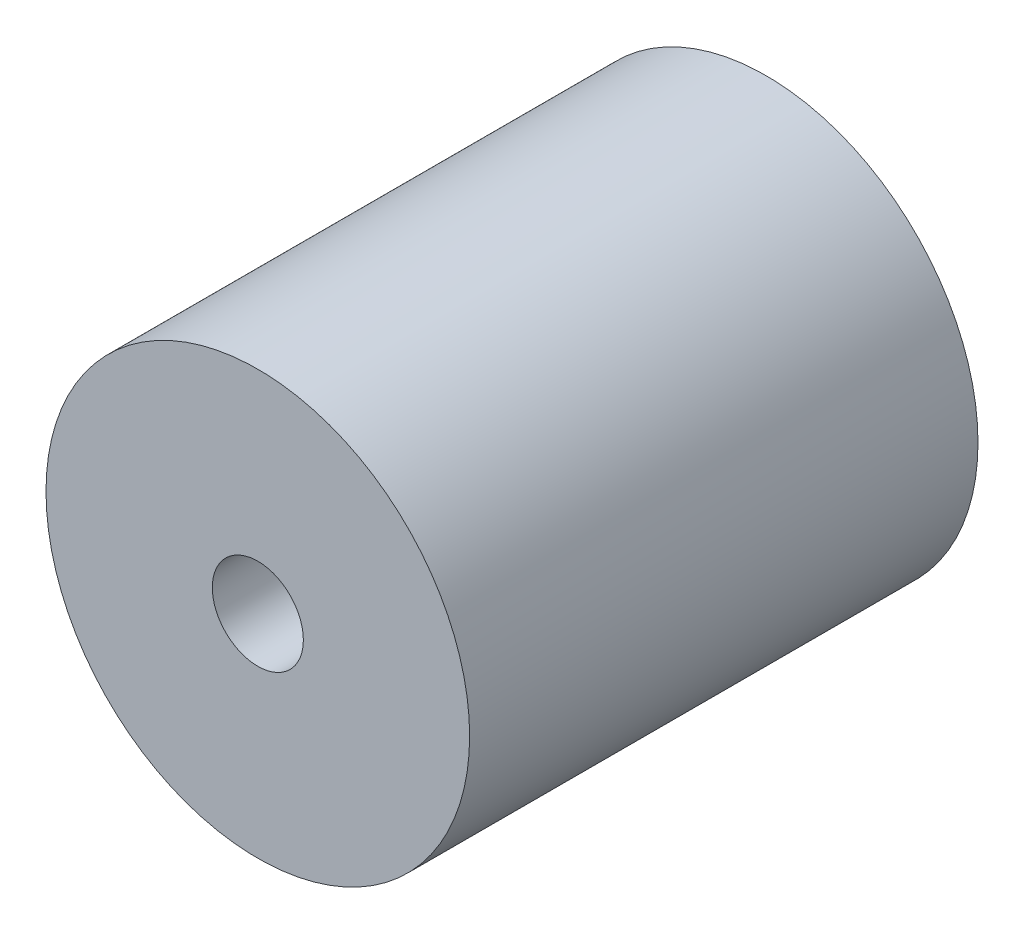
ISO-10303-21;
HEADER;
FILE_DESCRIPTION(('STEP AP214'),'2;1');
FILE_NAME('part.step','',(''),(''),'','','');
FILE_SCHEMA(('AUTOMOTIVE_DESIGN { 1 0 10303 214 1 1 1 1 }'));
ENDSEC;
DATA;
#1=APPLICATION_CONTEXT('core data for automotive mechanical design processes');
#2=APPLICATION_PROTOCOL_DEFINITION('international standard','automotive_design',2000,#1);
#3=PRODUCT_CONTEXT('',#1,'mechanical');
#4=PRODUCT('Part','Part','',(#3));
#5=PRODUCT_RELATED_PRODUCT_CATEGORY('part','',(#4));
#6=PRODUCT_DEFINITION_FORMATION('','',#4);
#7=PRODUCT_DEFINITION_CONTEXT('part definition',#1,'design');
#8=PRODUCT_DEFINITION('design','',#6,#7);
#9=PRODUCT_DEFINITION_SHAPE('','',#8);
#10=(LENGTH_UNIT() NAMED_UNIT(*) SI_UNIT(.MILLI.,.METRE.));
#11=(NAMED_UNIT(*) PLANE_ANGLE_UNIT() SI_UNIT($,.RADIAN.));
#12=(NAMED_UNIT(*) SI_UNIT($,.STERADIAN.) SOLID_ANGLE_UNIT());
#13=UNCERTAINTY_MEASURE_WITH_UNIT(LENGTH_MEASURE(1.E-05),#10,'distance_accuracy_value','');
#14=(GEOMETRIC_REPRESENTATION_CONTEXT(3) GLOBAL_UNCERTAINTY_ASSIGNED_CONTEXT((#13)) GLOBAL_UNIT_ASSIGNED_CONTEXT((#10,
#11,#12)) REPRESENTATION_CONTEXT('',''));
#15=CARTESIAN_POINT('',(0.,0.,0.));
#16=DIRECTION('',(0.,0.,1.));
#17=DIRECTION('',(1.,0.,0.));
#18=AXIS2_PLACEMENT_3D('',#15,#16,#17);
#19=CARTESIAN_POINT('',(0.,0.,24.));
#20=DIRECTION('',(0.,0.,1.));
#21=DIRECTION('',(1.,0.,0.));
#22=AXIS2_PLACEMENT_3D('',#19,#20,#21);
#23=PLANE('',#22);
#24=CARTESIAN_POINT('',(0.,0.,24.));
#25=DIRECTION('',(0.,0.,1.));
#26=DIRECTION('',(1.,0.,0.));
#27=AXIS2_PLACEMENT_3D('',#24,#25,#26);
#28=CIRCLE('',#27,10.);
#29=CARTESIAN_POINT('',(10.,0.,24.));
#30=VERTEX_POINT('',#29);
#31=EDGE_CURVE('E10',#30,#30,#28,.T.);
#32=ORIENTED_EDGE('',*,*,#31,.T.);
#33=EDGE_LOOP('',(#32));
#34=FACE_BOUND('',#33,.T.);
#35=CARTESIAN_POINT('',(0.,0.,24.));
#36=DIRECTION('',(0.,0.,1.));
#37=DIRECTION('',(1.,0.,0.));
#38=AXIS2_PLACEMENT_3D('',#35,#36,#37);
#39=CIRCLE('',#38,2.15);
#40=CARTESIAN_POINT('',(2.15,0.,24.));
#41=VERTEX_POINT('',#40);
#42=EDGE_CURVE('E44',#41,#41,#39,.T.);
#43=ORIENTED_EDGE('',*,*,#42,.F.);
#44=EDGE_LOOP('',(#43));
#45=FACE_BOUND('',#44,.T.);
#46=ADVANCED_FACE('F33',(#34,#45),#23,.T.);
#47=CARTESIAN_POINT('',(0.,0.,0.));
#48=DIRECTION('',(0.,0.,1.));
#49=DIRECTION('',(1.,0.,0.));
#50=AXIS2_PLACEMENT_3D('',#47,#48,#49);
#51=PLANE('',#50);
#52=CARTESIAN_POINT('',(0.,0.,0.));
#53=DIRECTION('',(0.,0.,1.));
#54=DIRECTION('',(1.,0.,0.));
#55=AXIS2_PLACEMENT_3D('',#52,#53,#54);
#56=CIRCLE('',#55,10.);
#57=CARTESIAN_POINT('',(10.,0.,0.));
#58=VERTEX_POINT('',#57);
#59=EDGE_CURVE('E37',#58,#58,#56,.T.);
#60=ORIENTED_EDGE('',*,*,#59,.F.);
#61=EDGE_LOOP('',(#60));
#62=FACE_BOUND('',#61,.T.);
#63=CARTESIAN_POINT('',(0.,0.,0.));
#64=DIRECTION('',(0.,0.,1.));
#65=DIRECTION('',(1.,0.,0.));
#66=AXIS2_PLACEMENT_3D('',#63,#64,#65);
#67=CIRCLE('',#66,2.15);
#68=CARTESIAN_POINT('',(2.15,0.,0.));
#69=VERTEX_POINT('',#68);
#70=EDGE_CURVE('E46',#69,#69,#67,.T.);
#71=ORIENTED_EDGE('',*,*,#70,.T.);
#72=EDGE_LOOP('',(#71));
#73=FACE_BOUND('',#72,.T.);
#74=ADVANCED_FACE('F56',(#62,#73),#51,.F.);
#75=CARTESIAN_POINT('',(0.,0.,24.));
#76=DIRECTION('',(0.,0.,-1.));
#77=DIRECTION('',(-1.,0.,0.));
#78=AXIS2_PLACEMENT_3D('',#75,#76,#77);
#79=CYLINDRICAL_SURFACE('',#78,10.);
#80=ORIENTED_EDGE('',*,*,#31,.F.);
#81=EDGE_LOOP('',(#80));
#82=FACE_BOUND('',#81,.T.);
#83=ORIENTED_EDGE('',*,*,#59,.T.);
#84=EDGE_LOOP('',(#83));
#85=FACE_BOUND('',#84,.T.);
#86=ADVANCED_FACE('F35',(#82,#85),#79,.T.);
#87=CARTESIAN_POINT('',(0.,0.,24.));
#88=DIRECTION('',(0.,0.,-1.));
#89=DIRECTION('',(-1.,0.,0.));
#90=AXIS2_PLACEMENT_3D('',#87,#88,#89);
#91=CYLINDRICAL_SURFACE('',#90,2.15);
#92=ORIENTED_EDGE('',*,*,#42,.T.);
#93=EDGE_LOOP('',(#92));
#94=FACE_BOUND('',#93,.T.);
#95=ORIENTED_EDGE('',*,*,#70,.F.);
#96=EDGE_LOOP('',(#95));
#97=FACE_BOUND('',#96,.T.);
#98=ADVANCED_FACE('F52',(#94,#97),#91,.F.);
#99=CLOSED_SHELL('',(#46,#74,#86,#98));
#100=MANIFOLD_SOLID_BREP('B2',#99);
#101=ADVANCED_BREP_SHAPE_REPRESENTATION('',(#18,#100),#14);
#102=SHAPE_DEFINITION_REPRESENTATION(#9,#101);
ENDSEC;
END-ISO-10303-21;
